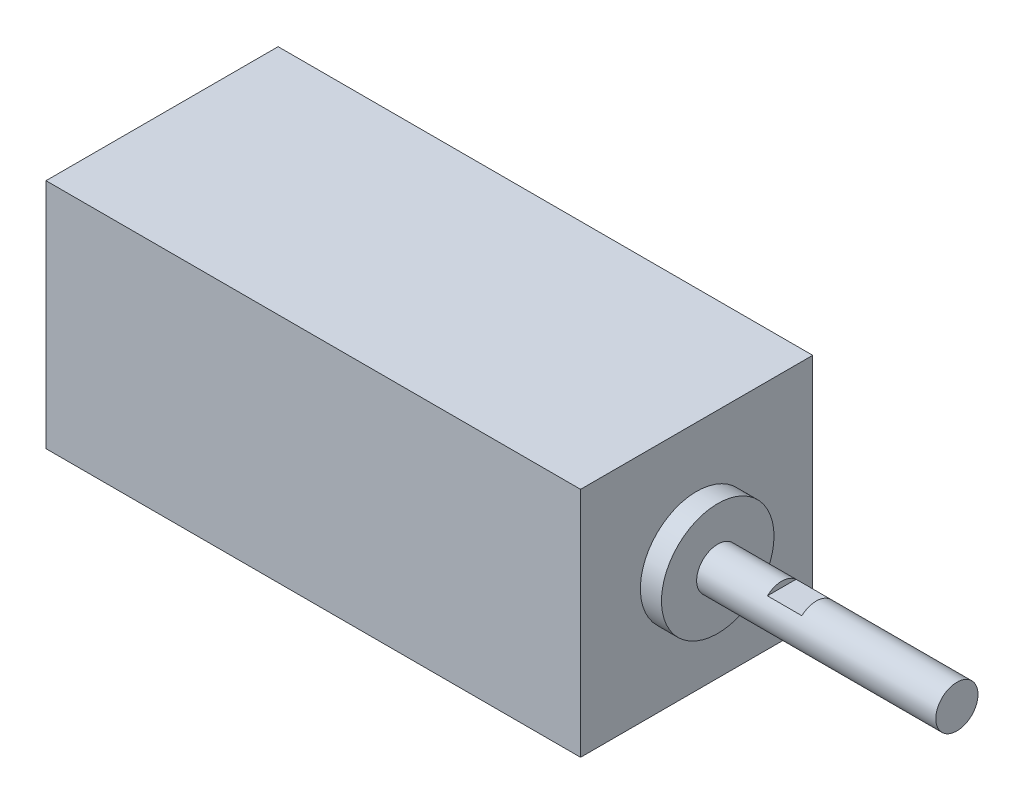
ISO-10303-21;
HEADER;
FILE_DESCRIPTION(('STEP AP214'),'2;1');
FILE_NAME('part.step','',(''),(''),'','','');
FILE_SCHEMA(('AUTOMOTIVE_DESIGN { 1 0 10303 214 1 1 1 1 }'));
ENDSEC;
DATA;
#1=APPLICATION_CONTEXT('core data for automotive mechanical design processes');
#2=APPLICATION_PROTOCOL_DEFINITION('international standard','automotive_design',2000,#1);
#3=PRODUCT_CONTEXT('',#1,'mechanical');
#4=PRODUCT('Part','Part','',(#3));
#5=PRODUCT_RELATED_PRODUCT_CATEGORY('part','',(#4));
#6=PRODUCT_DEFINITION_FORMATION('','',#4);
#7=PRODUCT_DEFINITION_CONTEXT('part definition',#1,'design');
#8=PRODUCT_DEFINITION('design','',#6,#7);
#9=PRODUCT_DEFINITION_SHAPE('','',#8);
#10=(LENGTH_UNIT() NAMED_UNIT(*) SI_UNIT(.MILLI.,.METRE.));
#11=(NAMED_UNIT(*) PLANE_ANGLE_UNIT() SI_UNIT($,.RADIAN.));
#12=(NAMED_UNIT(*) SI_UNIT($,.STERADIAN.) SOLID_ANGLE_UNIT());
#13=UNCERTAINTY_MEASURE_WITH_UNIT(LENGTH_MEASURE(1.E-05),#10,'distance_accuracy_value','');
#14=(GEOMETRIC_REPRESENTATION_CONTEXT(3) GLOBAL_UNCERTAINTY_ASSIGNED_CONTEXT((#13)) GLOBAL_UNIT_ASSIGNED_CONTEXT((#10,
#11,#12)) REPRESENTATION_CONTEXT('',''));
#15=CARTESIAN_POINT('',(0.,0.,0.));
#16=DIRECTION('',(0.,0.,1.));
#17=DIRECTION('',(1.,0.,0.));
#18=AXIS2_PLACEMENT_3D('',#15,#16,#17);
#19=CARTESIAN_POINT('',(38.,-16.5,-16.5));
#20=DIRECTION('',(0.,0.,1.));
#21=DIRECTION('',(1.,0.,0.));
#22=AXIS2_PLACEMENT_3D('',#19,#20,#21);
#23=PLANE('',#22);
#24=DIRECTION('',(0.,1.,0.));
#25=VECTOR('',#24,1.);
#26=CARTESIAN_POINT('',(-38.,-16.5,-16.5));
#27=LINE('',#26,#25);
#28=CARTESIAN_POINT('',(-38.,-16.5,-16.5));
#29=VERTEX_POINT('',#28);
#30=CARTESIAN_POINT('',(-38.,16.5,-16.5));
#31=VERTEX_POINT('',#30);
#32=EDGE_CURVE('E128',#29,#31,#27,.T.);
#33=ORIENTED_EDGE('',*,*,#32,.T.);
#34=DIRECTION('',(-1.,0.,0.));
#35=VECTOR('',#34,1.);
#36=CARTESIAN_POINT('',(38.,16.5,-16.5));
#37=LINE('',#36,#35);
#38=CARTESIAN_POINT('',(38.,16.5,-16.5));
#39=VERTEX_POINT('',#38);
#40=EDGE_CURVE('E112',#39,#31,#37,.T.);
#41=ORIENTED_EDGE('',*,*,#40,.F.);
#42=DIRECTION('',(0.,1.,0.));
#43=VECTOR('',#42,1.);
#44=CARTESIAN_POINT('',(38.,-16.5,-16.5));
#45=LINE('',#44,#43);
#46=CARTESIAN_POINT('',(38.,-16.5,-16.5));
#47=VERTEX_POINT('',#46);
#48=EDGE_CURVE('E123',#47,#39,#45,.T.);
#49=ORIENTED_EDGE('',*,*,#48,.F.);
#50=DIRECTION('',(-1.,0.,0.));
#51=VECTOR('',#50,1.);
#52=CARTESIAN_POINT('',(38.,-16.5,-16.5));
#53=LINE('',#52,#51);
#54=EDGE_CURVE('E120',#47,#29,#53,.T.);
#55=ORIENTED_EDGE('',*,*,#54,.T.);
#56=EDGE_LOOP('',(#33,#41,#49,#55));
#57=FACE_BOUND('',#56,.T.);
#58=ADVANCED_FACE('F34',(#57),#23,.F.);
#59=CARTESIAN_POINT('',(38.,16.5,16.5));
#60=DIRECTION('',(0.,-1.,0.));
#61=DIRECTION('',(0.,0.,-1.));
#62=AXIS2_PLACEMENT_3D('',#59,#60,#61);
#63=PLANE('',#62);
#64=DIRECTION('',(0.,0.,1.));
#65=VECTOR('',#64,1.);
#66=CARTESIAN_POINT('',(-38.,16.5,16.5));
#67=LINE('',#66,#65);
#68=CARTESIAN_POINT('',(-38.,16.5,16.5));
#69=VERTEX_POINT('',#68);
#70=EDGE_CURVE('E126',#31,#69,#67,.T.);
#71=ORIENTED_EDGE('',*,*,#70,.T.);
#72=DIRECTION('',(-1.,0.,0.));
#73=VECTOR('',#72,1.);
#74=CARTESIAN_POINT('',(38.,16.5,16.5));
#75=LINE('',#74,#73);
#76=CARTESIAN_POINT('',(38.,16.5,16.5));
#77=VERTEX_POINT('',#76);
#78=EDGE_CURVE('E115',#77,#69,#75,.T.);
#79=ORIENTED_EDGE('',*,*,#78,.F.);
#80=DIRECTION('',(0.,0.,1.));
#81=VECTOR('',#80,1.);
#82=CARTESIAN_POINT('',(38.,16.5,16.5));
#83=LINE('',#82,#81);
#84=EDGE_CURVE('E85',#39,#77,#83,.T.);
#85=ORIENTED_EDGE('',*,*,#84,.F.);
#86=ORIENTED_EDGE('',*,*,#40,.T.);
#87=EDGE_LOOP('',(#71,#79,#85,#86));
#88=FACE_BOUND('',#87,.T.);
#89=ADVANCED_FACE('F160',(#88),#63,.F.);
#90=CARTESIAN_POINT('',(38.,-16.5,16.5));
#91=DIRECTION('',(0.,0.,-1.));
#92=DIRECTION('',(-1.,0.,0.));
#93=AXIS2_PLACEMENT_3D('',#90,#91,#92);
#94=PLANE('',#93);
#95=DIRECTION('',(0.,-1.,0.));
#96=VECTOR('',#95,1.);
#97=CARTESIAN_POINT('',(-38.,-16.5,16.5));
#98=LINE('',#97,#96);
#99=CARTESIAN_POINT('',(-38.,-16.5,16.5));
#100=VERTEX_POINT('',#99);
#101=EDGE_CURVE('E124',#69,#100,#98,.T.);
#102=ORIENTED_EDGE('',*,*,#101,.T.);
#103=DIRECTION('',(-1.,0.,0.));
#104=VECTOR('',#103,1.);
#105=CARTESIAN_POINT('',(38.,-16.5,16.5));
#106=LINE('',#105,#104);
#107=CARTESIAN_POINT('',(38.,-16.5,16.5));
#108=VERTEX_POINT('',#107);
#109=EDGE_CURVE('E118',#108,#100,#106,.T.);
#110=ORIENTED_EDGE('',*,*,#109,.F.);
#111=DIRECTION('',(0.,-1.,0.));
#112=VECTOR('',#111,1.);
#113=CARTESIAN_POINT('',(38.,-16.5,16.5));
#114=LINE('',#113,#112);
#115=EDGE_CURVE('E133',#77,#108,#114,.T.);
#116=ORIENTED_EDGE('',*,*,#115,.F.);
#117=ORIENTED_EDGE('',*,*,#78,.T.);
#118=EDGE_LOOP('',(#102,#110,#116,#117));
#119=FACE_BOUND('',#118,.T.);
#120=ADVANCED_FACE('F165',(#119),#94,.F.);
#121=CARTESIAN_POINT('',(38.,-16.5,16.5));
#122=DIRECTION('',(0.,1.,0.));
#123=DIRECTION('',(0.,0.,1.));
#124=AXIS2_PLACEMENT_3D('',#121,#122,#123);
#125=PLANE('',#124);
#126=DIRECTION('',(0.,0.,-1.));
#127=VECTOR('',#126,1.);
#128=CARTESIAN_POINT('',(-38.,-16.5,16.5));
#129=LINE('',#128,#127);
#130=EDGE_CURVE('E77',#100,#29,#129,.T.);
#131=ORIENTED_EDGE('',*,*,#130,.T.);
#132=ORIENTED_EDGE('',*,*,#54,.F.);
#133=DIRECTION('',(0.,0.,-1.));
#134=VECTOR('',#133,1.);
#135=CARTESIAN_POINT('',(38.,-16.5,16.5));
#136=LINE('',#135,#134);
#137=EDGE_CURVE('E56',#108,#47,#136,.T.);
#138=ORIENTED_EDGE('',*,*,#137,.F.);
#139=ORIENTED_EDGE('',*,*,#109,.T.);
#140=EDGE_LOOP('',(#131,#132,#138,#139));
#141=FACE_BOUND('',#140,.T.);
#142=ADVANCED_FACE('F177',(#141),#125,.F.);
#143=CARTESIAN_POINT('',(38.,0.,0.));
#144=DIRECTION('',(-1.,0.,0.));
#145=DIRECTION('',(0.,0.,1.));
#146=AXIS2_PLACEMENT_3D('',#143,#144,#145);
#147=PLANE('',#146);
#148=CARTESIAN_POINT('',(38.,0.,0.));
#149=DIRECTION('',(1.,0.,0.));
#150=DIRECTION('',(0.,0.,-1.));
#151=AXIS2_PLACEMENT_3D('',#148,#149,#150);
#152=CIRCLE('',#151,8.);
#153=CARTESIAN_POINT('',(38.,0.,-8.));
#154=VERTEX_POINT('',#153);
#155=EDGE_CURVE('E114',#154,#154,#152,.T.);
#156=ORIENTED_EDGE('',*,*,#155,.F.);
#157=EDGE_LOOP('',(#156));
#158=FACE_BOUND('',#157,.T.);
#159=ORIENTED_EDGE('',*,*,#48,.T.);
#160=ORIENTED_EDGE('',*,*,#84,.T.);
#161=ORIENTED_EDGE('',*,*,#115,.T.);
#162=ORIENTED_EDGE('',*,*,#137,.T.);
#163=EDGE_LOOP('',(#159,#160,#161,#162));
#164=FACE_BOUND('',#163,.T.);
#165=ADVANCED_FACE('F175',(#158,#164),#147,.F.);
#166=CARTESIAN_POINT('',(-38.,0.,0.));
#167=DIRECTION('',(-1.,0.,0.));
#168=DIRECTION('',(0.,0.,1.));
#169=AXIS2_PLACEMENT_3D('',#166,#167,#168);
#170=PLANE('',#169);
#171=ORIENTED_EDGE('',*,*,#32,.F.);
#172=ORIENTED_EDGE('',*,*,#130,.F.);
#173=ORIENTED_EDGE('',*,*,#101,.F.);
#174=ORIENTED_EDGE('',*,*,#70,.F.);
#175=EDGE_LOOP('',(#171,#172,#173,#174));
#176=FACE_BOUND('',#175,.T.);
#177=ADVANCED_FACE('F170',(#176),#170,.T.);
#178=CARTESIAN_POINT('',(41.,0.,0.));
#179=DIRECTION('',(-1.,0.,0.));
#180=DIRECTION('',(0.,0.,1.));
#181=AXIS2_PLACEMENT_3D('',#178,#179,#180);
#182=CYLINDRICAL_SURFACE('',#181,8.);
#183=CARTESIAN_POINT('',(41.,0.,0.));
#184=DIRECTION('',(1.,0.,0.));
#185=DIRECTION('',(0.,0.,-1.));
#186=AXIS2_PLACEMENT_3D('',#183,#184,#185);
#187=CIRCLE('',#186,8.);
#188=CARTESIAN_POINT('',(41.,0.,-8.));
#189=VERTEX_POINT('',#188);
#190=EDGE_CURVE('E131',#189,#189,#187,.T.);
#191=ORIENTED_EDGE('',*,*,#190,.F.);
#192=EDGE_LOOP('',(#191));
#193=FACE_BOUND('',#192,.T.);
#194=ORIENTED_EDGE('',*,*,#155,.T.);
#195=EDGE_LOOP('',(#194));
#196=FACE_BOUND('',#195,.T.);
#197=ADVANCED_FACE('F184',(#193,#196),#182,.T.);
#198=CARTESIAN_POINT('',(41.,0.,0.));
#199=DIRECTION('',(1.,0.,0.));
#200=DIRECTION('',(0.,0.,-1.));
#201=AXIS2_PLACEMENT_3D('',#198,#199,#200);
#202=PLANE('',#201);
#203=CARTESIAN_POINT('',(41.,0.,0.));
#204=DIRECTION('',(1.,0.,0.));
#205=DIRECTION('',(0.,0.,-1.));
#206=AXIS2_PLACEMENT_3D('',#203,#204,#205);
#207=CIRCLE('',#206,3.);
#208=CARTESIAN_POINT('',(41.,0.,-3.));
#209=VERTEX_POINT('',#208);
#210=EDGE_CURVE('E100',#209,#209,#207,.T.);
#211=ORIENTED_EDGE('',*,*,#210,.F.);
#212=EDGE_LOOP('',(#211));
#213=FACE_BOUND('',#212,.T.);
#214=ORIENTED_EDGE('',*,*,#190,.T.);
#215=EDGE_LOOP('',(#214));
#216=FACE_BOUND('',#215,.T.);
#217=ADVANCED_FACE('F219',(#213,#216),#202,.T.);
#218=CARTESIAN_POINT('',(75.,0.,0.));
#219=DIRECTION('',(-1.,0.,0.));
#220=DIRECTION('',(0.,0.,1.));
#221=AXIS2_PLACEMENT_3D('',#218,#219,#220);
#222=CYLINDRICAL_SURFACE('',#221,3.);
#223=DIRECTION('',(-1.,0.,0.));
#224=VECTOR('',#223,1.);
#225=CARTESIAN_POINT('',(75.,2.20252880298233,-2.03687674443821));
#226=LINE('',#225,#224);
#227=CARTESIAN_POINT('',(50.1,2.20252880298233,-2.03687674443822));
#228=VERTEX_POINT('',#227);
#229=CARTESIAN_POINT('',(55.,2.20252880298233,-2.03687674443821));
#230=VERTEX_POINT('',#229);
#231=EDGE_CURVE('E99',#228,#230,#226,.F.);
#232=ORIENTED_EDGE('',*,*,#231,.T.);
#233=CARTESIAN_POINT('',(55.,0.,0.));
#234=DIRECTION('',(1.,0.,0.));
#235=DIRECTION('',(0.,0.,-1.));
#236=AXIS2_PLACEMENT_3D('',#233,#234,#235);
#237=CIRCLE('',#236,3.);
#238=CARTESIAN_POINT('',(55.,2.20252880298233,2.03687674443821));
#239=VERTEX_POINT('',#238);
#240=EDGE_CURVE('E11',#230,#239,#237,.T.);
#241=ORIENTED_EDGE('',*,*,#240,.T.);
#242=DIRECTION('',(-1.,0.,0.));
#243=VECTOR('',#242,1.);
#244=CARTESIAN_POINT('',(75.,2.20252880298233,2.03687674443821));
#245=LINE('',#244,#243);
#246=CARTESIAN_POINT('',(50.1,2.20252880298233,2.03687674443822));
#247=VERTEX_POINT('',#246);
#248=EDGE_CURVE('E41',#239,#247,#245,.T.);
#249=ORIENTED_EDGE('',*,*,#248,.T.);
#250=CARTESIAN_POINT('',(50.1,0.,0.));
#251=DIRECTION('',(-1.,0.,0.));
#252=DIRECTION('',(0.,0.,1.));
#253=AXIS2_PLACEMENT_3D('',#250,#251,#252);
#254=CIRCLE('',#253,3.);
#255=EDGE_CURVE('E94',#247,#228,#254,.T.);
#256=ORIENTED_EDGE('',*,*,#255,.T.);
#257=EDGE_LOOP('',(#232,#241,#249,#256));
#258=FACE_BOUND('',#257,.T.);
#259=CARTESIAN_POINT('',(75.,0.,0.));
#260=DIRECTION('',(1.,0.,0.));
#261=DIRECTION('',(0.,0.,-1.));
#262=AXIS2_PLACEMENT_3D('',#259,#260,#261);
#263=CIRCLE('',#262,3.);
#264=CARTESIAN_POINT('',(75.,0.,-3.));
#265=VERTEX_POINT('',#264);
#266=EDGE_CURVE('E141',#265,#265,#263,.T.);
#267=ORIENTED_EDGE('',*,*,#266,.F.);
#268=EDGE_LOOP('',(#267));
#269=FACE_BOUND('',#268,.T.);
#270=ORIENTED_EDGE('',*,*,#210,.T.);
#271=EDGE_LOOP('',(#270));
#272=FACE_BOUND('',#271,.T.);
#273=ADVANCED_FACE('F108',(#258,#269,#272),#222,.T.);
#274=CARTESIAN_POINT('',(75.,0.,0.));
#275=DIRECTION('',(1.,0.,0.));
#276=DIRECTION('',(0.,0.,-1.));
#277=AXIS2_PLACEMENT_3D('',#274,#275,#276);
#278=PLANE('',#277);
#279=ORIENTED_EDGE('',*,*,#266,.T.);
#280=EDGE_LOOP('',(#279));
#281=FACE_BOUND('',#280,.T.);
#282=ADVANCED_FACE('F149',(#281),#278,.T.);
#283=CARTESIAN_POINT('',(55.,7.03858677391622,-17.));
#284=DIRECTION('',(1.,0.,0.));
#285=DIRECTION('',(0.,0.,-1.));
#286=AXIS2_PLACEMENT_3D('',#283,#284,#285);
#287=PLANE('',#286);
#288=DIRECTION('',(0.,0.,1.));
#289=VECTOR('',#288,1.);
#290=CARTESIAN_POINT('',(55.,2.20252880298233,-17.));
#291=LINE('',#290,#289);
#292=EDGE_CURVE('E106',#230,#239,#291,.T.);
#293=ORIENTED_EDGE('',*,*,#292,.T.);
#294=ORIENTED_EDGE('',*,*,#240,.F.);
#295=EDGE_LOOP('',(#293,#294));
#296=FACE_BOUND('',#295,.T.);
#297=ADVANCED_FACE('F147',(#296),#287,.F.);
#298=CARTESIAN_POINT('',(50.1,2.20252880298233,-17.));
#299=DIRECTION('',(0.,-1.,0.));
#300=DIRECTION('',(1.,0.,0.));
#301=AXIS2_PLACEMENT_3D('',#298,#299,#300);
#302=PLANE('',#301);
#303=ORIENTED_EDGE('',*,*,#292,.F.);
#304=ORIENTED_EDGE('',*,*,#231,.F.);
#305=DIRECTION('',(0.,0.,1.));
#306=VECTOR('',#305,1.);
#307=CARTESIAN_POINT('',(50.1,2.20252880298233,-17.));
#308=LINE('',#307,#306);
#309=EDGE_CURVE('E47',#228,#247,#308,.T.);
#310=ORIENTED_EDGE('',*,*,#309,.T.);
#311=ORIENTED_EDGE('',*,*,#248,.F.);
#312=EDGE_LOOP('',(#303,#304,#310,#311));
#313=FACE_BOUND('',#312,.T.);
#314=ADVANCED_FACE('F104',(#313),#302,.F.);
#315=CARTESIAN_POINT('',(50.1,7.03858677391622,-17.));
#316=DIRECTION('',(-1.,0.,0.));
#317=DIRECTION('',(0.,0.,1.));
#318=AXIS2_PLACEMENT_3D('',#315,#316,#317);
#319=PLANE('',#318);
#320=ORIENTED_EDGE('',*,*,#309,.F.);
#321=ORIENTED_EDGE('',*,*,#255,.F.);
#322=EDGE_LOOP('',(#320,#321));
#323=FACE_BOUND('',#322,.T.);
#324=ADVANCED_FACE('F95',(#323),#319,.F.);
#325=CLOSED_SHELL('',(#58,#89,#120,#142,#165,#177,#197,#217,#273,#282,#297,#314,#324));
#326=MANIFOLD_SOLID_BREP('B2',#325);
#327=ADVANCED_BREP_SHAPE_REPRESENTATION('',(#18,#326),#14);
#328=SHAPE_DEFINITION_REPRESENTATION(#9,#327);
ENDSEC;
END-ISO-10303-21;
